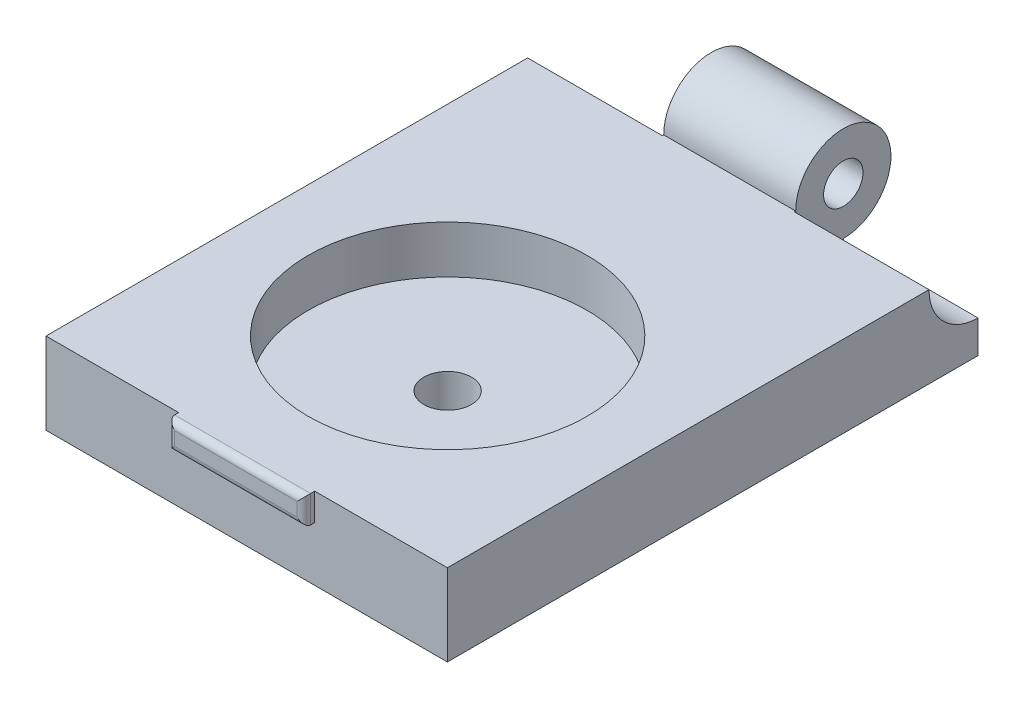
ISO-10303-21;
HEADER;
FILE_DESCRIPTION(('STEP AP214'),'2;1');
FILE_NAME('part.step','',(''),(''),'','','');
FILE_SCHEMA(('AUTOMOTIVE_DESIGN { 1 0 10303 214 1 1 1 1 }'));
ENDSEC;
DATA;
#1=APPLICATION_CONTEXT('core data for automotive mechanical design processes');
#2=APPLICATION_PROTOCOL_DEFINITION('international standard','automotive_design',2000,#1);
#3=PRODUCT_CONTEXT('',#1,'mechanical');
#4=PRODUCT('Part','Part','',(#3));
#5=PRODUCT_RELATED_PRODUCT_CATEGORY('part','',(#4));
#6=PRODUCT_DEFINITION_FORMATION('','',#4);
#7=PRODUCT_DEFINITION_CONTEXT('part definition',#1,'design');
#8=PRODUCT_DEFINITION('design','',#6,#7);
#9=PRODUCT_DEFINITION_SHAPE('','',#8);
#10=(LENGTH_UNIT() NAMED_UNIT(*) SI_UNIT(.MILLI.,.METRE.));
#11=(NAMED_UNIT(*) PLANE_ANGLE_UNIT() SI_UNIT($,.RADIAN.));
#12=(NAMED_UNIT(*) SI_UNIT($,.STERADIAN.) SOLID_ANGLE_UNIT());
#13=UNCERTAINTY_MEASURE_WITH_UNIT(LENGTH_MEASURE(1.E-05),#10,'distance_accuracy_value','');
#14=(GEOMETRIC_REPRESENTATION_CONTEXT(3) GLOBAL_UNCERTAINTY_ASSIGNED_CONTEXT((#13)) GLOBAL_UNIT_ASSIGNED_CONTEXT((#10,
#11,#12)) REPRESENTATION_CONTEXT('',''));
#15=CARTESIAN_POINT('',(0.,0.,0.));
#16=DIRECTION('',(0.,0.,1.));
#17=DIRECTION('',(1.,0.,0.));
#18=AXIS2_PLACEMENT_3D('',#15,#16,#17);
#19=CARTESIAN_POINT('',(-11.4406085030267,6.,21.8083806304807));
#20=DIRECTION('',(0.,0.,-1.));
#21=DIRECTION('',(-1.,0.,0.));
#22=AXIS2_PLACEMENT_3D('',#19,#20,#21);
#23=PLANE('',#22);
#24=DIRECTION('',(0.,-1.,0.));
#25=VECTOR('',#24,1.);
#26=CARTESIAN_POINT('',(-1.69060850302673,6.,21.8083806304807));
#27=LINE('',#26,#25);
#28=CARTESIAN_POINT('',(-1.69060850302673,6.,21.8083806304807));
#29=VERTEX_POINT('',#28);
#30=CARTESIAN_POINT('',(-1.69060850302673,4.,21.8083806304807));
#31=VERTEX_POINT('',#30);
#32=EDGE_CURVE('E159',#29,#31,#27,.T.);
#33=ORIENTED_EDGE('',*,*,#32,.F.);
#34=DIRECTION('',(1.,0.,0.));
#35=VECTOR('',#34,1.);
#36=CARTESIAN_POINT('',(-11.4406085030267,6.,21.8083806304807));
#37=LINE('',#36,#35);
#38=CARTESIAN_POINT('',(-11.4406085030267,6.,21.8083806304807));
#39=VERTEX_POINT('',#38);
#40=EDGE_CURVE('E220',#39,#29,#37,.T.);
#41=ORIENTED_EDGE('',*,*,#40,.F.);
#42=DIRECTION('',(0.,-1.,0.));
#43=VECTOR('',#42,1.);
#44=CARTESIAN_POINT('',(-11.4406085030267,6.,21.8083806304807));
#45=LINE('',#44,#43);
#46=CARTESIAN_POINT('',(-11.4406085030267,0.,21.8083806304807));
#47=VERTEX_POINT('',#46);
#48=EDGE_CURVE('E242',#39,#47,#45,.T.);
#49=ORIENTED_EDGE('',*,*,#48,.T.);
#50=DIRECTION('',(1.,0.,0.));
#51=VECTOR('',#50,1.);
#52=CARTESIAN_POINT('',(-11.4406085030267,0.,21.8083806304807));
#53=LINE('',#52,#51);
#54=CARTESIAN_POINT('',(18.0593914969733,0.,21.8083806304807));
#55=VERTEX_POINT('',#54);
#56=EDGE_CURVE('E229',#47,#55,#53,.T.);
#57=ORIENTED_EDGE('',*,*,#56,.T.);
#58=DIRECTION('',(0.,-1.,0.));
#59=VECTOR('',#58,1.);
#60=CARTESIAN_POINT('',(18.0593914969733,6.,21.8083806304807));
#61=LINE('',#60,#59);
#62=CARTESIAN_POINT('',(18.0593914969733,6.,21.8083806304807));
#63=VERTEX_POINT('',#62);
#64=EDGE_CURVE('E239',#63,#55,#61,.T.);
#65=ORIENTED_EDGE('',*,*,#64,.F.);
#66=CARTESIAN_POINT('',(8.30939149697327,6.,21.8083806304807));
#67=VERTEX_POINT('',#66);
#68=EDGE_CURVE('E155',#67,#63,#37,.T.);
#69=ORIENTED_EDGE('',*,*,#68,.F.);
#70=DIRECTION('',(0.,1.,0.));
#71=VECTOR('',#70,1.);
#72=CARTESIAN_POINT('',(8.30939149697327,6.,21.8083806304807));
#73=LINE('',#72,#71);
#74=CARTESIAN_POINT('',(8.30939149697327,4.,21.8083806304807));
#75=VERTEX_POINT('',#74);
#76=EDGE_CURVE('E143',#75,#67,#73,.T.);
#77=ORIENTED_EDGE('',*,*,#76,.F.);
#78=DIRECTION('',(1.,0.,0.));
#79=VECTOR('',#78,1.);
#80=CARTESIAN_POINT('',(-1.69060850302673,4.,21.8083806304807));
#81=LINE('',#80,#79);
#82=EDGE_CURVE('E152',#31,#75,#81,.T.);
#83=ORIENTED_EDGE('',*,*,#82,.F.);
#84=EDGE_LOOP('',(#33,#41,#49,#57,#65,#69,#77,#83));
#85=FACE_BOUND('',#84,.T.);
#86=ADVANCED_FACE('F34',(#85),#23,.F.);
#87=CARTESIAN_POINT('',(-11.4406085030267,6.,-17.1916193695193));
#88=DIRECTION('',(1.,0.,0.));
#89=DIRECTION('',(0.,0.,-1.));
#90=AXIS2_PLACEMENT_3D('',#87,#88,#89);
#91=PLANE('',#90);
#92=DIRECTION('',(0.,0.,1.));
#93=VECTOR('',#92,1.);
#94=CARTESIAN_POINT('',(-11.4406085030267,6.,-17.1916193695193));
#95=LINE('',#94,#93);
#96=CARTESIAN_POINT('',(-11.4406085030267,6.,-13.5916193695193));
#97=VERTEX_POINT('',#96);
#98=EDGE_CURVE('E217',#97,#39,#95,.T.);
#99=ORIENTED_EDGE('',*,*,#98,.F.);
#100=CARTESIAN_POINT('',(-11.4406085030267,6.,-17.1916193695193));
#101=DIRECTION('',(-1.,0.,0.));
#102=DIRECTION('',(0.,0.,1.));
#103=AXIS2_PLACEMENT_3D('',#100,#101,#102);
#104=CIRCLE('',#103,3.6);
#105=CARTESIAN_POINT('',(-11.4406085030267,2.4,-17.1916193695193));
#106=VERTEX_POINT('',#105);
#107=EDGE_CURVE('E183',#106,#97,#104,.T.);
#108=ORIENTED_EDGE('',*,*,#107,.F.);
#109=DIRECTION('',(0.,-1.,0.));
#110=VECTOR('',#109,1.);
#111=CARTESIAN_POINT('',(-11.4406085030267,6.,-17.1916193695193));
#112=LINE('',#111,#110);
#113=CARTESIAN_POINT('',(-11.4406085030267,0.,-17.1916193695193));
#114=VERTEX_POINT('',#113);
#115=EDGE_CURVE('E226',#106,#114,#112,.T.);
#116=ORIENTED_EDGE('',*,*,#115,.T.);
#117=DIRECTION('',(0.,0.,1.));
#118=VECTOR('',#117,1.);
#119=CARTESIAN_POINT('',(-11.4406085030267,0.,-17.1916193695193));
#120=LINE('',#119,#118);
#121=EDGE_CURVE('E214',#114,#47,#120,.T.);
#122=ORIENTED_EDGE('',*,*,#121,.T.);
#123=ORIENTED_EDGE('',*,*,#48,.F.);
#124=EDGE_LOOP('',(#99,#108,#116,#122,#123));
#125=FACE_BOUND('',#124,.T.);
#126=ADVANCED_FACE('F308',(#125),#91,.F.);
#127=CARTESIAN_POINT('',(18.0593914969733,6.,-17.1916193695193));
#128=DIRECTION('',(-1.,0.,0.));
#129=DIRECTION('',(0.,0.,1.));
#130=AXIS2_PLACEMENT_3D('',#127,#128,#129);
#131=PLANE('',#130);
#132=DIRECTION('',(0.,-1.,0.));
#133=VECTOR('',#132,1.);
#134=CARTESIAN_POINT('',(18.0593914969733,6.,-17.1916193695193));
#135=LINE('',#134,#133);
#136=CARTESIAN_POINT('',(18.0593914969733,2.4,-17.1916193695193));
#137=VERTEX_POINT('',#136);
#138=CARTESIAN_POINT('',(18.0593914969733,0.,-17.1916193695193));
#139=VERTEX_POINT('',#138);
#140=EDGE_CURVE('E237',#137,#139,#135,.T.);
#141=ORIENTED_EDGE('',*,*,#140,.F.);
#142=CARTESIAN_POINT('',(18.0593914969733,6.,-17.1916193695193));
#143=DIRECTION('',(1.,0.,0.));
#144=DIRECTION('',(0.,0.,-1.));
#145=AXIS2_PLACEMENT_3D('',#142,#143,#144);
#146=CIRCLE('',#145,3.6);
#147=CARTESIAN_POINT('',(18.0593914969733,6.,-13.5916193695193));
#148=VERTEX_POINT('',#147);
#149=EDGE_CURVE('E193',#148,#137,#146,.T.);
#150=ORIENTED_EDGE('',*,*,#149,.F.);
#151=DIRECTION('',(0.,0.,-1.));
#152=VECTOR('',#151,1.);
#153=CARTESIAN_POINT('',(18.0593914969733,6.,-17.1916193695193));
#154=LINE('',#153,#152);
#155=EDGE_CURVE('E223',#63,#148,#154,.T.);
#156=ORIENTED_EDGE('',*,*,#155,.F.);
#157=ORIENTED_EDGE('',*,*,#64,.T.);
#158=DIRECTION('',(0.,0.,-1.));
#159=VECTOR('',#158,1.);
#160=CARTESIAN_POINT('',(18.0593914969733,0.,-17.1916193695193));
#161=LINE('',#160,#159);
#162=EDGE_CURVE('E231',#55,#139,#161,.T.);
#163=ORIENTED_EDGE('',*,*,#162,.T.);
#164=EDGE_LOOP('',(#141,#150,#156,#157,#163));
#165=FACE_BOUND('',#164,.T.);
#166=ADVANCED_FACE('F313',(#165),#131,.F.);
#167=CARTESIAN_POINT('',(-11.4406085030267,6.,-17.1916193695193));
#168=DIRECTION('',(0.,0.,1.));
#169=DIRECTION('',(1.,0.,0.));
#170=AXIS2_PLACEMENT_3D('',#167,#168,#169);
#171=PLANE('',#170);
#172=DIRECTION('',(0.,-1.,0.));
#173=VECTOR('',#172,1.);
#174=CARTESIAN_POINT('',(-1.54060850302673,6.,-17.1916193695193));
#175=LINE('',#174,#173);
#176=CARTESIAN_POINT('',(-1.54060850302673,2.5,-17.1916193695193));
#177=VERTEX_POINT('',#176);
#178=CARTESIAN_POINT('',(-1.54060850302673,2.4,-17.1916193695193));
#179=VERTEX_POINT('',#178);
#180=EDGE_CURVE('E187',#177,#179,#175,.T.);
#181=ORIENTED_EDGE('',*,*,#180,.F.);
#182=DIRECTION('',(-1.,0.,0.));
#183=VECTOR('',#182,1.);
#184=CARTESIAN_POINT('',(18.0588864335849,2.5,-17.1916193695193));
#185=LINE('',#184,#183);
#186=CARTESIAN_POINT('',(8.15939149697327,2.5,-17.1916193695193));
#187=VERTEX_POINT('',#186);
#188=EDGE_CURVE('E181',#177,#187,#185,.F.);
#189=ORIENTED_EDGE('',*,*,#188,.T.);
#190=DIRECTION('',(0.,1.,0.));
#191=VECTOR('',#190,1.);
#192=CARTESIAN_POINT('',(8.15939149697327,6.,-17.1916193695193));
#193=LINE('',#192,#191);
#194=CARTESIAN_POINT('',(8.15939149697327,2.4,-17.1916193695193));
#195=VERTEX_POINT('',#194);
#196=EDGE_CURVE('E197',#195,#187,#193,.T.);
#197=ORIENTED_EDGE('',*,*,#196,.F.);
#198=DIRECTION('',(1.,0.,0.));
#199=VECTOR('',#198,1.);
#200=CARTESIAN_POINT('',(8.15939149697327,2.4,-17.1916193695193));
#201=LINE('',#200,#199);
#202=EDGE_CURVE('E201',#195,#137,#201,.T.);
#203=ORIENTED_EDGE('',*,*,#202,.T.);
#204=ORIENTED_EDGE('',*,*,#140,.T.);
#205=DIRECTION('',(-1.,0.,0.));
#206=VECTOR('',#205,1.);
#207=CARTESIAN_POINT('',(-11.4406085030267,0.,-17.1916193695193));
#208=LINE('',#207,#206);
#209=EDGE_CURVE('E219',#139,#114,#208,.T.);
#210=ORIENTED_EDGE('',*,*,#209,.T.);
#211=ORIENTED_EDGE('',*,*,#115,.F.);
#212=DIRECTION('',(-1.,0.,0.));
#213=VECTOR('',#212,1.);
#214=CARTESIAN_POINT('',(-1.54060850302673,2.4,-17.1916193695193));
#215=LINE('',#214,#213);
#216=EDGE_CURVE('E190',#106,#179,#215,.F.);
#217=ORIENTED_EDGE('',*,*,#216,.T.);
#218=EDGE_LOOP('',(#181,#189,#197,#203,#204,#210,#211,#217));
#219=FACE_BOUND('',#218,.T.);
#220=ADVANCED_FACE('F379',(#219),#171,.F.);
#221=CARTESIAN_POINT('',(0.,6.,0.));
#222=DIRECTION('',(0.,1.,0.));
#223=DIRECTION('',(0.,0.,1.));
#224=AXIS2_PLACEMENT_3D('',#221,#222,#223);
#225=PLANE('',#224);
#226=DIRECTION('',(0.,0.,-1.));
#227=VECTOR('',#226,1.);
#228=CARTESIAN_POINT('',(-1.69060850302673,6.,22.6083806304807));
#229=LINE('',#228,#227);
#230=CARTESIAN_POINT('',(-1.69060850302673,6.,22.1083806304807));
#231=VERTEX_POINT('',#230);
#232=EDGE_CURVE('E156',#231,#29,#229,.T.);
#233=ORIENTED_EDGE('',*,*,#232,.F.);
#234=DIRECTION('',(-1.,0.,0.));
#235=VECTOR('',#234,1.);
#236=CARTESIAN_POINT('',(0.,6.,22.1083806304807));
#237=LINE('',#236,#235);
#238=CARTESIAN_POINT('',(8.30939149697327,6.,22.1083806304807));
#239=VERTEX_POINT('',#238);
#240=EDGE_CURVE('E263',#231,#239,#237,.F.);
#241=ORIENTED_EDGE('',*,*,#240,.T.);
#242=DIRECTION('',(0.,0.,-1.));
#243=VECTOR('',#242,1.);
#244=CARTESIAN_POINT('',(8.30939149697327,6.,22.6083806304807));
#245=LINE('',#244,#243);
#246=EDGE_CURVE('E146',#239,#67,#245,.T.);
#247=ORIENTED_EDGE('',*,*,#246,.T.);
#248=ORIENTED_EDGE('',*,*,#68,.T.);
#249=ORIENTED_EDGE('',*,*,#155,.T.);
#250=DIRECTION('',(1.,0.,0.));
#251=VECTOR('',#250,1.);
#252=CARTESIAN_POINT('',(8.15939149697327,6.,-13.5916193695193));
#253=LINE('',#252,#251);
#254=CARTESIAN_POINT('',(8.15939149697327,6.,-13.5916193695193));
#255=VERTEX_POINT('',#254);
#256=EDGE_CURVE('E247',#255,#148,#253,.T.);
#257=ORIENTED_EDGE('',*,*,#256,.F.);
#258=DIRECTION('',(0.,0.,-1.));
#259=VECTOR('',#258,1.);
#260=CARTESIAN_POINT('',(8.15939149697327,6.,0.));
#261=LINE('',#260,#259);
#262=CARTESIAN_POINT('',(8.15939149697327,6.,-13.6916193695193));
#263=VERTEX_POINT('',#262);
#264=EDGE_CURVE('E245',#255,#263,#261,.T.);
#265=ORIENTED_EDGE('',*,*,#264,.T.);
#266=DIRECTION('',(-1.,0.,0.));
#267=VECTOR('',#266,1.);
#268=CARTESIAN_POINT('',(18.0588864335849,6.,-13.6916193695193));
#269=LINE('',#268,#267);
#270=CARTESIAN_POINT('',(-1.54060850302673,6.,-13.6916193695193));
#271=VERTEX_POINT('',#270);
#272=EDGE_CURVE('E178',#271,#263,#269,.F.);
#273=ORIENTED_EDGE('',*,*,#272,.F.);
#274=DIRECTION('',(0.,0.,1.));
#275=VECTOR('',#274,1.);
#276=CARTESIAN_POINT('',(-1.54060850302673,6.,0.));
#277=LINE('',#276,#275);
#278=CARTESIAN_POINT('',(-1.54060850302673,6.,-13.5916193695193));
#279=VERTEX_POINT('',#278);
#280=EDGE_CURVE('E249',#271,#279,#277,.T.);
#281=ORIENTED_EDGE('',*,*,#280,.T.);
#282=DIRECTION('',(-1.,0.,0.));
#283=VECTOR('',#282,1.);
#284=CARTESIAN_POINT('',(-1.54060850302673,6.,-13.5916193695193));
#285=LINE('',#284,#283);
#286=EDGE_CURVE('E251',#97,#279,#285,.F.);
#287=ORIENTED_EDGE('',*,*,#286,.F.);
#288=ORIENTED_EDGE('',*,*,#98,.T.);
#289=ORIENTED_EDGE('',*,*,#40,.T.);
#290=EDGE_LOOP('',(#233,#241,#247,#248,#249,#257,#265,#273,#281,#287,#288,#289));
#291=FACE_BOUND('',#290,.T.);
#292=CARTESIAN_POINT('',(3.30939149697327,6.,7.03844927409136));
#293=DIRECTION('',(0.,1.,0.));
#294=DIRECTION('',(0.,0.,1.));
#295=AXIS2_PLACEMENT_3D('',#292,#293,#294);
#296=CIRCLE('',#295,10.25);
#297=CARTESIAN_POINT('',(3.30939149697327,6.,17.2884492740914));
#298=VERTEX_POINT('',#297);
#299=EDGE_CURVE('E208',#298,#298,#296,.T.);
#300=ORIENTED_EDGE('',*,*,#299,.F.);
#301=EDGE_LOOP('',(#300));
#302=FACE_BOUND('',#301,.T.);
#303=ADVANCED_FACE('F292',(#291,#302),#225,.T.);
#304=CARTESIAN_POINT('',(0.,0.,0.));
#305=DIRECTION('',(0.,1.,0.));
#306=DIRECTION('',(0.,0.,1.));
#307=AXIS2_PLACEMENT_3D('',#304,#305,#306);
#308=PLANE('',#307);
#309=CARTESIAN_POINT('',(3.30939149697327,0.,7.03844927409136));
#310=DIRECTION('',(0.,1.,0.));
#311=DIRECTION('',(0.,0.,1.));
#312=AXIS2_PLACEMENT_3D('',#309,#310,#311);
#313=CIRCLE('',#312,1.75);
#314=CARTESIAN_POINT('',(3.30939149697327,0.,8.78844927409136));
#315=VERTEX_POINT('',#314);
#316=EDGE_CURVE('E205',#315,#315,#313,.T.);
#317=ORIENTED_EDGE('',*,*,#316,.T.);
#318=EDGE_LOOP('',(#317));
#319=FACE_BOUND('',#318,.T.);
#320=ORIENTED_EDGE('',*,*,#121,.F.);
#321=ORIENTED_EDGE('',*,*,#209,.F.);
#322=ORIENTED_EDGE('',*,*,#162,.F.);
#323=ORIENTED_EDGE('',*,*,#56,.F.);
#324=EDGE_LOOP('',(#320,#321,#322,#323));
#325=FACE_BOUND('',#324,.T.);
#326=ADVANCED_FACE('F378',(#319,#325),#308,.F.);
#327=CARTESIAN_POINT('',(3.30939149697327,2.5,7.03844927409136));
#328=DIRECTION('',(0.,1.,0.));
#329=DIRECTION('',(0.,0.,1.));
#330=AXIS2_PLACEMENT_3D('',#327,#328,#329);
#331=CYLINDRICAL_SURFACE('',#330,10.25);
#332=CARTESIAN_POINT('',(3.30939149697327,2.5,7.03844927409136));
#333=DIRECTION('',(0.,1.,0.));
#334=DIRECTION('',(0.,0.,1.));
#335=AXIS2_PLACEMENT_3D('',#332,#333,#334);
#336=CIRCLE('',#335,10.25);
#337=CARTESIAN_POINT('',(3.30939149697327,2.5,17.2884492740914));
#338=VERTEX_POINT('',#337);
#339=EDGE_CURVE('E211',#338,#338,#336,.T.);
#340=ORIENTED_EDGE('',*,*,#339,.F.);
#341=EDGE_LOOP('',(#340));
#342=FACE_BOUND('',#341,.T.);
#343=ORIENTED_EDGE('',*,*,#299,.T.);
#344=EDGE_LOOP('',(#343));
#345=FACE_BOUND('',#344,.T.);
#346=ADVANCED_FACE('F472',(#342,#345),#331,.F.);
#347=CARTESIAN_POINT('',(3.30939149697327,2.5,7.03844927409136));
#348=DIRECTION('',(0.,1.,0.));
#349=DIRECTION('',(0.,0.,1.));
#350=AXIS2_PLACEMENT_3D('',#347,#348,#349);
#351=PLANE('',#350);
#352=CARTESIAN_POINT('',(3.30939149697327,2.5,7.03844927409136));
#353=DIRECTION('',(0.,1.,0.));
#354=DIRECTION('',(0.,0.,1.));
#355=AXIS2_PLACEMENT_3D('',#352,#353,#354);
#356=CIRCLE('',#355,1.75);
#357=CARTESIAN_POINT('',(3.30939149697327,2.5,8.78844927409136));
#358=VERTEX_POINT('',#357);
#359=EDGE_CURVE('E204',#358,#358,#356,.T.);
#360=ORIENTED_EDGE('',*,*,#359,.F.);
#361=EDGE_LOOP('',(#360));
#362=FACE_BOUND('',#361,.T.);
#363=ORIENTED_EDGE('',*,*,#339,.T.);
#364=EDGE_LOOP('',(#363));
#365=FACE_BOUND('',#364,.T.);
#366=ADVANCED_FACE('F480',(#362,#365),#351,.T.);
#367=CARTESIAN_POINT('',(3.30939149697327,0.,7.03844927409136));
#368=DIRECTION('',(0.,1.,0.));
#369=DIRECTION('',(0.,0.,1.));
#370=AXIS2_PLACEMENT_3D('',#367,#368,#369);
#371=CYLINDRICAL_SURFACE('',#370,1.75);
#372=ORIENTED_EDGE('',*,*,#316,.F.);
#373=EDGE_LOOP('',(#372));
#374=FACE_BOUND('',#373,.T.);
#375=ORIENTED_EDGE('',*,*,#359,.T.);
#376=EDGE_LOOP('',(#375));
#377=FACE_BOUND('',#376,.T.);
#378=ADVANCED_FACE('F486',(#374,#377),#371,.F.);
#379=CARTESIAN_POINT('',(8.15939149697327,6.,-17.1916193695193));
#380=DIRECTION('',(1.,0.,0.));
#381=DIRECTION('',(0.,0.,-1.));
#382=AXIS2_PLACEMENT_3D('',#379,#380,#381);
#383=CYLINDRICAL_SURFACE('',#382,3.6);
#384=CARTESIAN_POINT('',(8.15939149697327,6.,-17.1916193695193));
#385=DIRECTION('',(1.,0.,0.));
#386=DIRECTION('',(0.,0.,-1.));
#387=AXIS2_PLACEMENT_3D('',#384,#385,#386);
#388=CIRCLE('',#387,3.6);
#389=EDGE_CURVE('E194',#255,#195,#388,.T.);
#390=ORIENTED_EDGE('',*,*,#389,.F.);
#391=ORIENTED_EDGE('',*,*,#256,.T.);
#392=ORIENTED_EDGE('',*,*,#149,.T.);
#393=ORIENTED_EDGE('',*,*,#202,.F.);
#394=EDGE_LOOP('',(#390,#391,#392,#393));
#395=FACE_BOUND('',#394,.T.);
#396=ADVANCED_FACE('F428',(#395),#383,.F.);
#397=CARTESIAN_POINT('',(8.15939149697327,6.,-17.1916193695193));
#398=DIRECTION('',(1.,0.,0.));
#399=DIRECTION('',(0.,0.,-1.));
#400=AXIS2_PLACEMENT_3D('',#397,#398,#399);
#401=PLANE('',#400);
#402=CARTESIAN_POINT('',(8.15939149697327,6.,-17.1916193695193));
#403=DIRECTION('',(1.,0.,0.));
#404=DIRECTION('',(0.,0.,-1.));
#405=AXIS2_PLACEMENT_3D('',#402,#403,#404);
#406=CIRCLE('',#405,1.45);
#407=CARTESIAN_POINT('',(8.15939149697327,6.,-18.6416193695193));
#408=VERTEX_POINT('',#407);
#409=EDGE_CURVE('E167',#408,#408,#406,.T.);
#410=ORIENTED_EDGE('',*,*,#409,.F.);
#411=EDGE_LOOP('',(#410));
#412=FACE_BOUND('',#411,.T.);
#413=ORIENTED_EDGE('',*,*,#196,.T.);
#414=CARTESIAN_POINT('',(8.15939149697327,6.,-17.1916193695193));
#415=DIRECTION('',(1.,0.,0.));
#416=DIRECTION('',(0.,0.,-1.));
#417=AXIS2_PLACEMENT_3D('',#414,#415,#416);
#418=CIRCLE('',#417,3.5);
#419=EDGE_CURVE('E175',#263,#187,#418,.F.);
#420=ORIENTED_EDGE('',*,*,#419,.F.);
#421=ORIENTED_EDGE('',*,*,#264,.F.);
#422=ORIENTED_EDGE('',*,*,#389,.T.);
#423=EDGE_LOOP('',(#413,#420,#421,#422));
#424=FACE_BOUND('',#423,.T.);
#425=ADVANCED_FACE('F423',(#412,#424),#401,.T.);
#426=CARTESIAN_POINT('',(-1.54060850302673,6.,-17.1916193695193));
#427=DIRECTION('',(-1.,0.,0.));
#428=DIRECTION('',(0.,0.,1.));
#429=AXIS2_PLACEMENT_3D('',#426,#427,#428);
#430=CYLINDRICAL_SURFACE('',#429,3.6);
#431=ORIENTED_EDGE('',*,*,#107,.T.);
#432=ORIENTED_EDGE('',*,*,#286,.T.);
#433=CARTESIAN_POINT('',(-1.54060850302673,6.,-17.1916193695193));
#434=DIRECTION('',(-1.,0.,0.));
#435=DIRECTION('',(0.,0.,1.));
#436=AXIS2_PLACEMENT_3D('',#433,#434,#435);
#437=CIRCLE('',#436,3.6);
#438=EDGE_CURVE('E184',#179,#279,#437,.T.);
#439=ORIENTED_EDGE('',*,*,#438,.F.);
#440=ORIENTED_EDGE('',*,*,#216,.F.);
#441=EDGE_LOOP('',(#431,#432,#439,#440));
#442=FACE_BOUND('',#441,.T.);
#443=ADVANCED_FACE('F416',(#442),#430,.F.);
#444=CARTESIAN_POINT('',(-1.54060850302673,6.,-17.1916193695193));
#445=DIRECTION('',(-1.,0.,0.));
#446=DIRECTION('',(0.,0.,1.));
#447=AXIS2_PLACEMENT_3D('',#444,#445,#446);
#448=PLANE('',#447);
#449=CARTESIAN_POINT('',(-1.54060850302673,6.,-17.1916193695193));
#450=DIRECTION('',(-1.,0.,0.));
#451=DIRECTION('',(0.,0.,1.));
#452=AXIS2_PLACEMENT_3D('',#449,#450,#451);
#453=CIRCLE('',#452,1.45);
#454=CARTESIAN_POINT('',(-1.54060850302673,6.,-15.7416193695193));
#455=VERTEX_POINT('',#454);
#456=EDGE_CURVE('E166',#455,#455,#453,.F.);
#457=ORIENTED_EDGE('',*,*,#456,.T.);
#458=EDGE_LOOP('',(#457));
#459=FACE_BOUND('',#458,.T.);
#460=CARTESIAN_POINT('',(-1.54060850302673,6.,-17.1916193695193));
#461=DIRECTION('',(-1.,0.,0.));
#462=DIRECTION('',(0.,0.,1.));
#463=AXIS2_PLACEMENT_3D('',#460,#461,#462);
#464=CIRCLE('',#463,3.5);
#465=EDGE_CURVE('E170',#271,#177,#464,.T.);
#466=ORIENTED_EDGE('',*,*,#465,.T.);
#467=ORIENTED_EDGE('',*,*,#180,.T.);
#468=ORIENTED_EDGE('',*,*,#438,.T.);
#469=ORIENTED_EDGE('',*,*,#280,.F.);
#470=EDGE_LOOP('',(#466,#467,#468,#469));
#471=FACE_BOUND('',#470,.T.);
#472=ADVANCED_FACE('F405',(#459,#471),#448,.T.);
#473=CARTESIAN_POINT('',(18.0588864335849,6.,-17.1916193695193));
#474=DIRECTION('',(-1.,0.,0.));
#475=DIRECTION('',(0.,0.,1.));
#476=AXIS2_PLACEMENT_3D('',#473,#474,#475);
#477=CYLINDRICAL_SURFACE('',#476,3.5);
#478=ORIENTED_EDGE('',*,*,#188,.F.);
#479=ORIENTED_EDGE('',*,*,#465,.F.);
#480=ORIENTED_EDGE('',*,*,#272,.T.);
#481=ORIENTED_EDGE('',*,*,#419,.T.);
#482=EDGE_LOOP('',(#478,#479,#480,#481));
#483=FACE_BOUND('',#482,.T.);
#484=ADVANCED_FACE('F395',(#483),#477,.T.);
#485=CARTESIAN_POINT('',(-11.4416085030267,6.,-17.1916193695193));
#486=DIRECTION('',(1.,0.,0.));
#487=DIRECTION('',(0.,0.,-1.));
#488=AXIS2_PLACEMENT_3D('',#485,#486,#487);
#489=CYLINDRICAL_SURFACE('',#488,1.45);
#490=ORIENTED_EDGE('',*,*,#456,.F.);
#491=EDGE_LOOP('',(#490));
#492=FACE_BOUND('',#491,.T.);
#493=ORIENTED_EDGE('',*,*,#409,.T.);
#494=EDGE_LOOP('',(#493));
#495=FACE_BOUND('',#494,.T.);
#496=ADVANCED_FACE('F369',(#492,#495),#489,.F.);
#497=CARTESIAN_POINT('',(-1.69060850302673,6.,22.6083806304807));
#498=DIRECTION('',(1.,0.,0.));
#499=DIRECTION('',(0.,1.,0.));
#500=AXIS2_PLACEMENT_3D('',#497,#498,#499);
#501=PLANE('',#500);
#502=DIRECTION('',(0.,0.,-1.));
#503=VECTOR('',#502,1.);
#504=CARTESIAN_POINT('',(-1.69060850302673,4.,22.6083806304807));
#505=LINE('',#504,#503);
#506=CARTESIAN_POINT('',(-1.69060850302673,4.,22.1083806304807));
#507=VERTEX_POINT('',#506);
#508=EDGE_CURVE('E145',#507,#31,#505,.T.);
#509=ORIENTED_EDGE('',*,*,#508,.F.);
#510=DIRECTION('',(0.,-1.,0.));
#511=VECTOR('',#510,1.);
#512=CARTESIAN_POINT('',(-1.69060850302673,6.,22.1083806304807));
#513=LINE('',#512,#511);
#514=EDGE_CURVE('E11',#507,#231,#513,.F.);
#515=ORIENTED_EDGE('',*,*,#514,.T.);
#516=ORIENTED_EDGE('',*,*,#232,.T.);
#517=ORIENTED_EDGE('',*,*,#32,.T.);
#518=EDGE_LOOP('',(#509,#515,#516,#517));
#519=FACE_BOUND('',#518,.T.);
#520=ADVANCED_FACE('F289',(#519),#501,.F.);
#521=CARTESIAN_POINT('',(-1.69060850302673,4.,22.6083806304807));
#522=DIRECTION('',(0.,1.,0.));
#523=DIRECTION('',(0.,0.,1.));
#524=AXIS2_PLACEMENT_3D('',#521,#522,#523);
#525=PLANE('',#524);
#526=DIRECTION('',(0.,0.,-1.));
#527=VECTOR('',#526,1.);
#528=CARTESIAN_POINT('',(8.30939149697327,4.,22.6083806304807));
#529=LINE('',#528,#527);
#530=CARTESIAN_POINT('',(8.30939149697327,4.,22.1083806304807));
#531=VERTEX_POINT('',#530);
#532=EDGE_CURVE('E140',#531,#75,#529,.T.);
#533=ORIENTED_EDGE('',*,*,#532,.F.);
#534=DIRECTION('',(1.,0.,0.));
#535=VECTOR('',#534,1.);
#536=CARTESIAN_POINT('',(-1.69060850302673,4.,22.1083806304807));
#537=LINE('',#536,#535);
#538=EDGE_CURVE('E43',#531,#507,#537,.F.);
#539=ORIENTED_EDGE('',*,*,#538,.T.);
#540=ORIENTED_EDGE('',*,*,#508,.T.);
#541=ORIENTED_EDGE('',*,*,#82,.T.);
#542=EDGE_LOOP('',(#533,#539,#540,#541));
#543=FACE_BOUND('',#542,.T.);
#544=ADVANCED_FACE('F158',(#543),#525,.F.);
#545=CARTESIAN_POINT('',(8.30939149697327,6.,22.6083806304807));
#546=DIRECTION('',(-1.,0.,0.));
#547=DIRECTION('',(0.,-1.,0.));
#548=AXIS2_PLACEMENT_3D('',#545,#546,#547);
#549=PLANE('',#548);
#550=ORIENTED_EDGE('',*,*,#246,.F.);
#551=DIRECTION('',(0.,1.,0.));
#552=VECTOR('',#551,1.);
#553=CARTESIAN_POINT('',(8.30939149697327,4.,22.1083806304807));
#554=LINE('',#553,#552);
#555=EDGE_CURVE('E58',#239,#531,#554,.F.);
#556=ORIENTED_EDGE('',*,*,#555,.T.);
#557=ORIENTED_EDGE('',*,*,#532,.T.);
#558=ORIENTED_EDGE('',*,*,#76,.T.);
#559=EDGE_LOOP('',(#550,#556,#557,#558));
#560=FACE_BOUND('',#559,.T.);
#561=ADVANCED_FACE('F142',(#560),#549,.F.);
#562=CARTESIAN_POINT('',(0.,0.,22.6083806304807));
#563=DIRECTION('',(0.,0.,1.));
#564=DIRECTION('',(1.,0.,0.));
#565=AXIS2_PLACEMENT_3D('',#562,#563,#564);
#566=PLANE('',#565);
#567=DIRECTION('',(0.,1.,0.));
#568=VECTOR('',#567,1.);
#569=CARTESIAN_POINT('',(7.80939149697327,6.,22.6083806304807));
#570=LINE('',#569,#568);
#571=CARTESIAN_POINT('',(7.80939149697327,4.5,22.6083806304807));
#572=VERTEX_POINT('',#571);
#573=CARTESIAN_POINT('',(7.80939149697327,5.5,22.6083806304807));
#574=VERTEX_POINT('',#573);
#575=EDGE_CURVE('E258',#572,#574,#570,.T.);
#576=ORIENTED_EDGE('',*,*,#575,.T.);
#577=DIRECTION('',(-1.,0.,0.));
#578=VECTOR('',#577,1.);
#579=CARTESIAN_POINT('',(0.,5.5,22.6083806304807));
#580=LINE('',#579,#578);
#581=CARTESIAN_POINT('',(-1.19060850302673,5.5,22.6083806304807));
#582=VERTEX_POINT('',#581);
#583=EDGE_CURVE('E260',#574,#582,#580,.T.);
#584=ORIENTED_EDGE('',*,*,#583,.T.);
#585=DIRECTION('',(0.,-1.,0.));
#586=VECTOR('',#585,1.);
#587=CARTESIAN_POINT('',(-1.19060850302673,4.,22.6083806304807));
#588=LINE('',#587,#586);
#589=CARTESIAN_POINT('',(-1.19060850302673,4.5,22.6083806304807));
#590=VERTEX_POINT('',#589);
#591=EDGE_CURVE('E254',#582,#590,#588,.T.);
#592=ORIENTED_EDGE('',*,*,#591,.T.);
#593=DIRECTION('',(1.,0.,0.));
#594=VECTOR('',#593,1.);
#595=CARTESIAN_POINT('',(8.30939149697327,4.5,22.6083806304807));
#596=LINE('',#595,#594);
#597=EDGE_CURVE('E256',#590,#572,#596,.T.);
#598=ORIENTED_EDGE('',*,*,#597,.T.);
#599=EDGE_LOOP('',(#576,#584,#592,#598));
#600=FACE_BOUND('',#599,.T.);
#601=ADVANCED_FACE('F299',(#600),#566,.T.);
#602=CARTESIAN_POINT('',(0.,4.5,22.1083806304807));
#603=DIRECTION('',(-1.,0.,0.));
#604=DIRECTION('',(0.,0.,1.));
#605=AXIS2_PLACEMENT_3D('',#602,#603,#604);
#606=CYLINDRICAL_SURFACE('',#605,0.5);
#607=CARTESIAN_POINT('',(-1.19060850302673,4.5,22.1083806304807));
#608=DIRECTION('',(-0.707106781186547,0.707106781186547,0.));
#609=DIRECTION('',(0.707106781186547,0.707106781186548,0.));
#610=AXIS2_PLACEMENT_3D('',#607,#608,#609);
#611=ELLIPSE('',#610,0.707106781186547,0.5);
#612=EDGE_CURVE('E271',#507,#590,#611,.T.);
#613=ORIENTED_EDGE('',*,*,#612,.F.);
#614=ORIENTED_EDGE('',*,*,#538,.F.);
#615=CARTESIAN_POINT('',(7.80939149697327,4.5,22.1083806304807));
#616=DIRECTION('',(-0.707106781186547,-0.707106781186548,0.));
#617=DIRECTION('',(-0.707106781186548,0.707106781186547,0.));
#618=AXIS2_PLACEMENT_3D('',#615,#616,#617);
#619=ELLIPSE('',#618,0.707106781186548,0.5);
#620=EDGE_CURVE('E38',#572,#531,#619,.F.);
#621=ORIENTED_EDGE('',*,*,#620,.F.);
#622=ORIENTED_EDGE('',*,*,#597,.F.);
#623=EDGE_LOOP('',(#613,#614,#621,#622));
#624=FACE_BOUND('',#623,.T.);
#625=ADVANCED_FACE('F36',(#624),#606,.T.);
#626=CARTESIAN_POINT('',(7.80939149697328,0.,22.1083806304807));
#627=DIRECTION('',(0.,-1.,0.));
#628=DIRECTION('',(1.,0.,0.));
#629=AXIS2_PLACEMENT_3D('',#626,#627,#628);
#630=CYLINDRICAL_SURFACE('',#629,0.5);
#631=ORIENTED_EDGE('',*,*,#620,.T.);
#632=ORIENTED_EDGE('',*,*,#555,.F.);
#633=CARTESIAN_POINT('',(7.80939149697327,5.5,22.1083806304807));
#634=DIRECTION('',(0.707106781186548,-0.707106781186547,0.));
#635=DIRECTION('',(-0.707106781186547,-0.707106781186548,0.));
#636=AXIS2_PLACEMENT_3D('',#633,#634,#635);
#637=ELLIPSE('',#636,0.707106781186547,0.5);
#638=EDGE_CURVE('E270',#574,#239,#637,.F.);
#639=ORIENTED_EDGE('',*,*,#638,.F.);
#640=ORIENTED_EDGE('',*,*,#575,.F.);
#641=EDGE_LOOP('',(#631,#632,#639,#640));
#642=FACE_BOUND('',#641,.T.);
#643=ADVANCED_FACE('F281',(#642),#630,.T.);
#644=CARTESIAN_POINT('',(-1.19060850302673,0.,22.1083806304807));
#645=DIRECTION('',(0.,1.,0.));
#646=DIRECTION('',(-1.,0.,0.));
#647=AXIS2_PLACEMENT_3D('',#644,#645,#646);
#648=CYLINDRICAL_SURFACE('',#647,0.5);
#649=ORIENTED_EDGE('',*,*,#612,.T.);
#650=ORIENTED_EDGE('',*,*,#591,.F.);
#651=CARTESIAN_POINT('',(-1.19060850302673,5.5,22.1083806304807));
#652=DIRECTION('',(0.707106781186547,0.707106781186548,0.));
#653=DIRECTION('',(-0.707106781186547,0.707106781186547,0.));
#654=AXIS2_PLACEMENT_3D('',#651,#652,#653);
#655=ELLIPSE('',#654,0.707106781186548,0.5);
#656=EDGE_CURVE('E268',#231,#582,#655,.T.);
#657=ORIENTED_EDGE('',*,*,#656,.F.);
#658=ORIENTED_EDGE('',*,*,#514,.F.);
#659=EDGE_LOOP('',(#649,#650,#657,#658));
#660=FACE_BOUND('',#659,.T.);
#661=ADVANCED_FACE('F286',(#660),#648,.T.);
#662=CARTESIAN_POINT('',(0.,5.5,22.1083806304807));
#663=DIRECTION('',(-1.,0.,0.));
#664=DIRECTION('',(0.,0.,1.));
#665=AXIS2_PLACEMENT_3D('',#662,#663,#664);
#666=CYLINDRICAL_SURFACE('',#665,0.5);
#667=ORIENTED_EDGE('',*,*,#638,.T.);
#668=ORIENTED_EDGE('',*,*,#240,.F.);
#669=ORIENTED_EDGE('',*,*,#656,.T.);
#670=ORIENTED_EDGE('',*,*,#583,.F.);
#671=EDGE_LOOP('',(#667,#668,#669,#670));
#672=FACE_BOUND('',#671,.T.);
#673=ADVANCED_FACE('F296',(#672),#666,.T.);
#674=CLOSED_SHELL('',(#86,#126,#166,#220,#303,#326,#346,#366,#378,#396,#425,#443,#472,#484,#496,
#520,#544,#561,#601,#625,#643,#661,#673));
#675=MANIFOLD_SOLID_BREP('B2',#674);
#676=ADVANCED_BREP_SHAPE_REPRESENTATION('',(#18,#675),#14);
#677=SHAPE_DEFINITION_REPRESENTATION(#9,#676);
ENDSEC;
END-ISO-10303-21;
